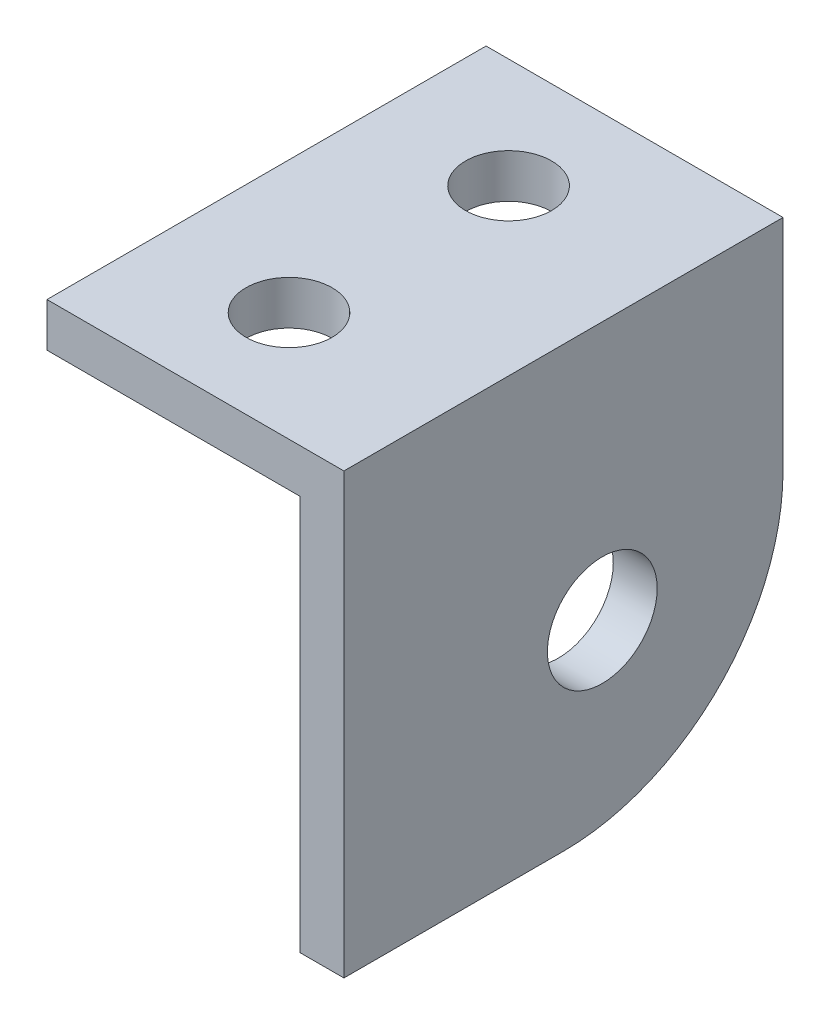
ISO-10303-21;
HEADER;
FILE_DESCRIPTION(('STEP AP214'),'2;1');
FILE_NAME('part.step','',(''),(''),'','','');
FILE_SCHEMA(('AUTOMOTIVE_DESIGN { 1 0 10303 214 1 1 1 1 }'));
ENDSEC;
DATA;
#1=APPLICATION_CONTEXT('core data for automotive mechanical design processes');
#2=APPLICATION_PROTOCOL_DEFINITION('international standard','automotive_design',2000,#1);
#3=PRODUCT_CONTEXT('',#1,'mechanical');
#4=PRODUCT('Part','Part','',(#3));
#5=PRODUCT_RELATED_PRODUCT_CATEGORY('part','',(#4));
#6=PRODUCT_DEFINITION_FORMATION('','',#4);
#7=PRODUCT_DEFINITION_CONTEXT('part definition',#1,'design');
#8=PRODUCT_DEFINITION('design','',#6,#7);
#9=PRODUCT_DEFINITION_SHAPE('','',#8);
#10=(LENGTH_UNIT() NAMED_UNIT(*) SI_UNIT(.MILLI.,.METRE.));
#11=(NAMED_UNIT(*) PLANE_ANGLE_UNIT() SI_UNIT($,.RADIAN.));
#12=(NAMED_UNIT(*) SI_UNIT($,.STERADIAN.) SOLID_ANGLE_UNIT());
#13=UNCERTAINTY_MEASURE_WITH_UNIT(LENGTH_MEASURE(1.E-05),#10,'distance_accuracy_value','');
#14=(GEOMETRIC_REPRESENTATION_CONTEXT(3) GLOBAL_UNCERTAINTY_ASSIGNED_CONTEXT((#13)) GLOBAL_UNIT_ASSIGNED_CONTEXT((#10,
#11,#12)) REPRESENTATION_CONTEXT('',''));
#15=CARTESIAN_POINT('',(0.,0.,0.));
#16=DIRECTION('',(0.,0.,1.));
#17=DIRECTION('',(1.,0.,0.));
#18=AXIS2_PLACEMENT_3D('',#15,#16,#17);
#19=CARTESIAN_POINT('',(-27.33675,12.7,25.4));
#20=DIRECTION('',(0.,-1.,0.));
#21=DIRECTION('',(0.,0.,-1.));
#22=AXIS2_PLACEMENT_3D('',#19,#20,#21);
#23=PLANE('',#22);
#24=CARTESIAN_POINT('',(-19.685,12.7,19.05));
#25=DIRECTION('',(0.,-1.,0.));
#26=DIRECTION('',(1.,0.,0.));
#27=AXIS2_PLACEMENT_3D('',#24,#25,#26);
#28=CIRCLE('',#27,2.4892);
#29=CARTESIAN_POINT('',(-17.1958,12.7,19.05));
#30=VERTEX_POINT('',#29);
#31=EDGE_CURVE('E154',#30,#30,#28,.T.);
#32=ORIENTED_EDGE('',*,*,#31,.T.);
#33=EDGE_LOOP('',(#32));
#34=FACE_BOUND('',#33,.T.);
#35=CARTESIAN_POINT('',(-19.685,12.7,6.35000000000001));
#36=DIRECTION('',(0.,-1.,0.));
#37=DIRECTION('',(1.,0.,0.));
#38=AXIS2_PLACEMENT_3D('',#35,#36,#37);
#39=CIRCLE('',#38,2.4892);
#40=CARTESIAN_POINT('',(-17.1958,12.7,6.35000000000001));
#41=VERTEX_POINT('',#40);
#42=EDGE_CURVE('E158',#41,#41,#39,.T.);
#43=ORIENTED_EDGE('',*,*,#42,.T.);
#44=EDGE_LOOP('',(#43));
#45=FACE_BOUND('',#44,.T.);
#46=DIRECTION('',(-1.,0.,0.));
#47=VECTOR('',#46,1.);
#48=CARTESIAN_POINT('',(-27.33675,12.7,0.));
#49=LINE('',#48,#47);
#50=CARTESIAN_POINT('',(-10.16,12.7,0.));
#51=VERTEX_POINT('',#50);
#52=CARTESIAN_POINT('',(-27.33675,12.7,0.));
#53=VERTEX_POINT('',#52);
#54=EDGE_CURVE('E116',#51,#53,#49,.T.);
#55=ORIENTED_EDGE('',*,*,#54,.T.);
#56=DIRECTION('',(0.,0.,-1.));
#57=VECTOR('',#56,1.);
#58=CARTESIAN_POINT('',(-27.33675,12.7,25.4));
#59=LINE('',#58,#57);
#60=CARTESIAN_POINT('',(-27.33675,12.7,25.4));
#61=VERTEX_POINT('',#60);
#62=EDGE_CURVE('E97',#61,#53,#59,.T.);
#63=ORIENTED_EDGE('',*,*,#62,.F.);
#64=DIRECTION('',(-1.,0.,0.));
#65=VECTOR('',#64,1.);
#66=CARTESIAN_POINT('',(-27.33675,12.7,25.4));
#67=LINE('',#66,#65);
#68=CARTESIAN_POINT('',(-10.16,12.7,25.4));
#69=VERTEX_POINT('',#68);
#70=EDGE_CURVE('E104',#69,#61,#67,.T.);
#71=ORIENTED_EDGE('',*,*,#70,.F.);
#72=DIRECTION('',(0.,0.,-1.));
#73=VECTOR('',#72,1.);
#74=CARTESIAN_POINT('',(-10.16,12.7,25.4));
#75=LINE('',#74,#73);
#76=EDGE_CURVE('E132',#69,#51,#75,.T.);
#77=ORIENTED_EDGE('',*,*,#76,.T.);
#78=EDGE_LOOP('',(#55,#63,#71,#77));
#79=FACE_BOUND('',#78,.T.);
#80=ADVANCED_FACE('F35',(#34,#45,#79),#23,.F.);
#81=CARTESIAN_POINT('',(-27.33675,10.16,25.4));
#82=DIRECTION('',(1.,0.,0.));
#83=DIRECTION('',(0.,0.,-1.));
#84=AXIS2_PLACEMENT_3D('',#81,#82,#83);
#85=PLANE('',#84);
#86=DIRECTION('',(0.,-1.,0.));
#87=VECTOR('',#86,1.);
#88=CARTESIAN_POINT('',(-27.33675,10.16,0.));
#89=LINE('',#88,#87);
#90=CARTESIAN_POINT('',(-27.33675,10.16,0.));
#91=VERTEX_POINT('',#90);
#92=EDGE_CURVE('E139',#53,#91,#89,.T.);
#93=ORIENTED_EDGE('',*,*,#92,.T.);
#94=DIRECTION('',(0.,0.,-1.));
#95=VECTOR('',#94,1.);
#96=CARTESIAN_POINT('',(-27.33675,10.16,25.4));
#97=LINE('',#96,#95);
#98=CARTESIAN_POINT('',(-27.33675,10.16,25.4));
#99=VERTEX_POINT('',#98);
#100=EDGE_CURVE('E100',#99,#91,#97,.T.);
#101=ORIENTED_EDGE('',*,*,#100,.F.);
#102=DIRECTION('',(0.,-1.,0.));
#103=VECTOR('',#102,1.);
#104=CARTESIAN_POINT('',(-27.33675,10.16,25.4));
#105=LINE('',#104,#103);
#106=EDGE_CURVE('E93',#61,#99,#105,.T.);
#107=ORIENTED_EDGE('',*,*,#106,.F.);
#108=ORIENTED_EDGE('',*,*,#62,.T.);
#109=EDGE_LOOP('',(#93,#101,#107,#108));
#110=FACE_BOUND('',#109,.T.);
#111=ADVANCED_FACE('F95',(#110),#85,.F.);
#112=CARTESIAN_POINT('',(-27.33675,10.16,25.4));
#113=DIRECTION('',(0.,1.,0.));
#114=DIRECTION('',(-1.,0.,0.));
#115=AXIS2_PLACEMENT_3D('',#112,#113,#114);
#116=PLANE('',#115);
#117=CARTESIAN_POINT('',(-19.685,10.16,19.05));
#118=DIRECTION('',(0.,-1.,0.));
#119=DIRECTION('',(1.,0.,0.));
#120=AXIS2_PLACEMENT_3D('',#117,#118,#119);
#121=CIRCLE('',#120,2.4892);
#122=CARTESIAN_POINT('',(-17.1958,10.16,19.05));
#123=VERTEX_POINT('',#122);
#124=EDGE_CURVE('E161',#123,#123,#121,.T.);
#125=ORIENTED_EDGE('',*,*,#124,.F.);
#126=EDGE_LOOP('',(#125));
#127=FACE_BOUND('',#126,.T.);
#128=CARTESIAN_POINT('',(-19.685,10.16,6.35000000000001));
#129=DIRECTION('',(0.,-1.,0.));
#130=DIRECTION('',(1.,0.,0.));
#131=AXIS2_PLACEMENT_3D('',#128,#129,#130);
#132=CIRCLE('',#131,2.4892);
#133=CARTESIAN_POINT('',(-17.1958,10.16,6.35000000000001));
#134=VERTEX_POINT('',#133);
#135=EDGE_CURVE('E155',#134,#134,#132,.T.);
#136=ORIENTED_EDGE('',*,*,#135,.F.);
#137=EDGE_LOOP('',(#136));
#138=FACE_BOUND('',#137,.T.);
#139=DIRECTION('',(1.,0.,0.));
#140=VECTOR('',#139,1.);
#141=CARTESIAN_POINT('',(-27.33675,10.16,0.));
#142=LINE('',#141,#140);
#143=CARTESIAN_POINT('',(-12.7,10.16,0.));
#144=VERTEX_POINT('',#143);
#145=EDGE_CURVE('E137',#91,#144,#142,.T.);
#146=ORIENTED_EDGE('',*,*,#145,.T.);
#147=DIRECTION('',(0.,0.,-1.));
#148=VECTOR('',#147,1.);
#149=CARTESIAN_POINT('',(-12.7,10.16,25.4));
#150=LINE('',#149,#148);
#151=CARTESIAN_POINT('',(-12.7,10.16,25.4));
#152=VERTEX_POINT('',#151);
#153=EDGE_CURVE('E121',#152,#144,#150,.T.);
#154=ORIENTED_EDGE('',*,*,#153,.F.);
#155=DIRECTION('',(1.,0.,0.));
#156=VECTOR('',#155,1.);
#157=CARTESIAN_POINT('',(-27.33675,10.16,25.4));
#158=LINE('',#157,#156);
#159=EDGE_CURVE('E103',#99,#152,#158,.T.);
#160=ORIENTED_EDGE('',*,*,#159,.F.);
#161=ORIENTED_EDGE('',*,*,#100,.T.);
#162=EDGE_LOOP('',(#146,#154,#160,#161));
#163=FACE_BOUND('',#162,.T.);
#164=ADVANCED_FACE('F176',(#127,#138,#163),#116,.F.);
#165=CARTESIAN_POINT('',(-12.7,10.16,25.4));
#166=DIRECTION('',(1.,0.,0.));
#167=DIRECTION('',(0.,1.,0.));
#168=AXIS2_PLACEMENT_3D('',#165,#166,#167);
#169=PLANE('',#168);
#170=CARTESIAN_POINT('',(-12.7,-2.24506403026729,10.4549359697327));
#171=DIRECTION('',(1.,0.,0.));
#172=DIRECTION('',(0.,1.,0.));
#173=AXIS2_PLACEMENT_3D('',#170,#171,#172);
#174=CIRCLE('',#173,3.175);
#175=CARTESIAN_POINT('',(-12.7,0.929935969732713,10.4549359697327));
#176=VERTEX_POINT('',#175);
#177=EDGE_CURVE('E142',#176,#176,#174,.T.);
#178=ORIENTED_EDGE('',*,*,#177,.T.);
#179=EDGE_LOOP('',(#178));
#180=FACE_BOUND('',#179,.T.);
#181=DIRECTION('',(0.,-1.,0.));
#182=VECTOR('',#181,1.);
#183=CARTESIAN_POINT('',(-12.7,10.16,0.));
#184=LINE('',#183,#182);
#185=CARTESIAN_POINT('',(-12.7,0.,0.));
#186=VERTEX_POINT('',#185);
#187=EDGE_CURVE('E135',#144,#186,#184,.T.);
#188=ORIENTED_EDGE('',*,*,#187,.T.);
#189=CARTESIAN_POINT('',(-12.7,0.,12.7));
#190=DIRECTION('',(1.,0.,0.));
#191=DIRECTION('',(0.,1.,0.));
#192=AXIS2_PLACEMENT_3D('',#189,#190,#191);
#193=CIRCLE('',#192,12.7);
#194=CARTESIAN_POINT('',(-12.7,-12.7,12.7));
#195=VERTEX_POINT('',#194);
#196=EDGE_CURVE('E11',#186,#195,#193,.F.);
#197=ORIENTED_EDGE('',*,*,#196,.T.);
#198=DIRECTION('',(0.,0.,-1.));
#199=VECTOR('',#198,1.);
#200=CARTESIAN_POINT('',(-12.7,-12.7,25.4));
#201=LINE('',#200,#199);
#202=CARTESIAN_POINT('',(-12.7,-12.7,25.4));
#203=VERTEX_POINT('',#202);
#204=EDGE_CURVE('E127',#203,#195,#201,.T.);
#205=ORIENTED_EDGE('',*,*,#204,.F.);
#206=DIRECTION('',(0.,-1.,0.));
#207=VECTOR('',#206,1.);
#208=CARTESIAN_POINT('',(-12.7,10.16,25.4));
#209=LINE('',#208,#207);
#210=EDGE_CURVE('E146',#152,#203,#209,.T.);
#211=ORIENTED_EDGE('',*,*,#210,.F.);
#212=ORIENTED_EDGE('',*,*,#153,.T.);
#213=EDGE_LOOP('',(#188,#197,#205,#211,#212));
#214=FACE_BOUND('',#213,.T.);
#215=ADVANCED_FACE('F179',(#180,#214),#169,.F.);
#216=CARTESIAN_POINT('',(-12.7,-12.7,25.4));
#217=DIRECTION('',(0.,1.,0.));
#218=DIRECTION('',(-1.,0.,0.));
#219=AXIS2_PLACEMENT_3D('',#216,#217,#218);
#220=PLANE('',#219);
#221=ORIENTED_EDGE('',*,*,#204,.T.);
#222=DIRECTION('',(1.,0.,0.));
#223=VECTOR('',#222,1.);
#224=CARTESIAN_POINT('',(-12.7,-12.7,12.7));
#225=LINE('',#224,#223);
#226=CARTESIAN_POINT('',(-10.16,-12.7,12.7));
#227=VERTEX_POINT('',#226);
#228=EDGE_CURVE('E117',#195,#227,#225,.T.);
#229=ORIENTED_EDGE('',*,*,#228,.T.);
#230=DIRECTION('',(0.,0.,-1.));
#231=VECTOR('',#230,1.);
#232=CARTESIAN_POINT('',(-10.16,-12.7,25.4));
#233=LINE('',#232,#231);
#234=CARTESIAN_POINT('',(-10.16,-12.7,25.4));
#235=VERTEX_POINT('',#234);
#236=EDGE_CURVE('E130',#235,#227,#233,.T.);
#237=ORIENTED_EDGE('',*,*,#236,.F.);
#238=DIRECTION('',(1.,0.,0.));
#239=VECTOR('',#238,1.);
#240=CARTESIAN_POINT('',(-12.7,-12.7,25.4));
#241=LINE('',#240,#239);
#242=EDGE_CURVE('E144',#203,#235,#241,.T.);
#243=ORIENTED_EDGE('',*,*,#242,.F.);
#244=EDGE_LOOP('',(#221,#229,#237,#243));
#245=FACE_BOUND('',#244,.T.);
#246=ADVANCED_FACE('F209',(#245),#220,.F.);
#247=CARTESIAN_POINT('',(-10.16,-12.7,25.4));
#248=DIRECTION('',(-1.,0.,0.));
#249=DIRECTION('',(0.,0.,1.));
#250=AXIS2_PLACEMENT_3D('',#247,#248,#249);
#251=PLANE('',#250);
#252=CARTESIAN_POINT('',(-10.16,-2.24506403026729,10.4549359697327));
#253=DIRECTION('',(1.,0.,0.));
#254=DIRECTION('',(0.,0.,-1.));
#255=AXIS2_PLACEMENT_3D('',#252,#253,#254);
#256=CIRCLE('',#255,3.175);
#257=CARTESIAN_POINT('',(-10.16,-2.24506403026729,7.27993596973271));
#258=VERTEX_POINT('',#257);
#259=EDGE_CURVE('E151',#258,#258,#256,.T.);
#260=ORIENTED_EDGE('',*,*,#259,.F.);
#261=EDGE_LOOP('',(#260));
#262=FACE_BOUND('',#261,.T.);
#263=ORIENTED_EDGE('',*,*,#236,.T.);
#264=CARTESIAN_POINT('',(-10.16,0.,12.7));
#265=DIRECTION('',(-1.,0.,0.));
#266=DIRECTION('',(0.,0.,1.));
#267=AXIS2_PLACEMENT_3D('',#264,#265,#266);
#268=CIRCLE('',#267,12.7);
#269=CARTESIAN_POINT('',(-10.16,0.,0.));
#270=VERTEX_POINT('',#269);
#271=EDGE_CURVE('E57',#227,#270,#268,.F.);
#272=ORIENTED_EDGE('',*,*,#271,.T.);
#273=DIRECTION('',(0.,1.,0.));
#274=VECTOR('',#273,1.);
#275=CARTESIAN_POINT('',(-10.16,-12.7,0.));
#276=LINE('',#275,#274);
#277=EDGE_CURVE('E113',#270,#51,#276,.T.);
#278=ORIENTED_EDGE('',*,*,#277,.T.);
#279=ORIENTED_EDGE('',*,*,#76,.F.);
#280=DIRECTION('',(0.,1.,0.));
#281=VECTOR('',#280,1.);
#282=CARTESIAN_POINT('',(-10.16,-12.7,25.4));
#283=LINE('',#282,#281);
#284=EDGE_CURVE('E109',#235,#69,#283,.T.);
#285=ORIENTED_EDGE('',*,*,#284,.F.);
#286=EDGE_LOOP('',(#263,#272,#278,#279,#285));
#287=FACE_BOUND('',#286,.T.);
#288=ADVANCED_FACE('F198',(#262,#287),#251,.F.);
#289=CARTESIAN_POINT('',(0.,0.,25.4));
#290=DIRECTION('',(0.,0.,1.));
#291=DIRECTION('',(1.,0.,0.));
#292=AXIS2_PLACEMENT_3D('',#289,#290,#291);
#293=PLANE('',#292);
#294=ORIENTED_EDGE('',*,*,#70,.T.);
#295=ORIENTED_EDGE('',*,*,#106,.T.);
#296=ORIENTED_EDGE('',*,*,#159,.T.);
#297=ORIENTED_EDGE('',*,*,#210,.T.);
#298=ORIENTED_EDGE('',*,*,#242,.T.);
#299=ORIENTED_EDGE('',*,*,#284,.T.);
#300=EDGE_LOOP('',(#294,#295,#296,#297,#298,#299));
#301=FACE_BOUND('',#300,.T.);
#302=ADVANCED_FACE('F107',(#301),#293,.T.);
#303=CARTESIAN_POINT('',(0.,0.,0.));
#304=DIRECTION('',(0.,0.,1.));
#305=DIRECTION('',(1.,0.,0.));
#306=AXIS2_PLACEMENT_3D('',#303,#304,#305);
#307=PLANE('',#306);
#308=ORIENTED_EDGE('',*,*,#277,.F.);
#309=DIRECTION('',(1.,0.,0.));
#310=VECTOR('',#309,1.);
#311=CARTESIAN_POINT('',(0.,0.,0.));
#312=LINE('',#311,#310);
#313=EDGE_CURVE('E43',#270,#186,#312,.F.);
#314=ORIENTED_EDGE('',*,*,#313,.T.);
#315=ORIENTED_EDGE('',*,*,#187,.F.);
#316=ORIENTED_EDGE('',*,*,#145,.F.);
#317=ORIENTED_EDGE('',*,*,#92,.F.);
#318=ORIENTED_EDGE('',*,*,#54,.F.);
#319=EDGE_LOOP('',(#308,#314,#315,#316,#317,#318));
#320=FACE_BOUND('',#319,.T.);
#321=ADVANCED_FACE('F189',(#320),#307,.F.);
#322=CARTESIAN_POINT('',(-12.7,0.,12.7));
#323=DIRECTION('',(1.,0.,0.));
#324=DIRECTION('',(0.,1.,0.));
#325=AXIS2_PLACEMENT_3D('',#322,#323,#324);
#326=CYLINDRICAL_SURFACE('',#325,12.7);
#327=ORIENTED_EDGE('',*,*,#196,.F.);
#328=ORIENTED_EDGE('',*,*,#313,.F.);
#329=ORIENTED_EDGE('',*,*,#271,.F.);
#330=ORIENTED_EDGE('',*,*,#228,.F.);
#331=EDGE_LOOP('',(#327,#328,#329,#330));
#332=FACE_BOUND('',#331,.T.);
#333=ADVANCED_FACE('F37',(#332),#326,.T.);
#334=CARTESIAN_POINT('',(-27.33675,-2.24506403026729,10.4549359697327));
#335=DIRECTION('',(1.,0.,0.));
#336=DIRECTION('',(0.,0.,-1.));
#337=AXIS2_PLACEMENT_3D('',#334,#335,#336);
#338=CYLINDRICAL_SURFACE('',#337,3.175);
#339=ORIENTED_EDGE('',*,*,#259,.T.);
#340=EDGE_LOOP('',(#339));
#341=FACE_BOUND('',#340,.T.);
#342=ORIENTED_EDGE('',*,*,#177,.F.);
#343=EDGE_LOOP('',(#342));
#344=FACE_BOUND('',#343,.T.);
#345=ADVANCED_FACE('F196',(#341,#344),#338,.F.);
#346=CARTESIAN_POINT('',(-19.685,12.7,6.35000000000001));
#347=DIRECTION('',(0.,-1.,0.));
#348=DIRECTION('',(1.,0.,0.));
#349=AXIS2_PLACEMENT_3D('',#346,#347,#348);
#350=CYLINDRICAL_SURFACE('',#349,2.4892);
#351=ORIENTED_EDGE('',*,*,#42,.F.);
#352=EDGE_LOOP('',(#351));
#353=FACE_BOUND('',#352,.T.);
#354=ORIENTED_EDGE('',*,*,#135,.T.);
#355=EDGE_LOOP('',(#354));
#356=FACE_BOUND('',#355,.T.);
#357=ADVANCED_FACE('F172',(#353,#356),#350,.F.);
#358=CARTESIAN_POINT('',(-19.685,12.7,19.05));
#359=DIRECTION('',(0.,-1.,0.));
#360=DIRECTION('',(1.,0.,0.));
#361=AXIS2_PLACEMENT_3D('',#358,#359,#360);
#362=CYLINDRICAL_SURFACE('',#361,2.4892);
#363=ORIENTED_EDGE('',*,*,#31,.F.);
#364=EDGE_LOOP('',(#363));
#365=FACE_BOUND('',#364,.T.);
#366=ORIENTED_EDGE('',*,*,#124,.T.);
#367=EDGE_LOOP('',(#366));
#368=FACE_BOUND('',#367,.T.);
#369=ADVANCED_FACE('F169',(#365,#368),#362,.F.);
#370=CLOSED_SHELL('',(#80,#111,#164,#215,#246,#288,#302,#321,#333,#345,#357,#369));
#371=MANIFOLD_SOLID_BREP('B2',#370);
#372=ADVANCED_BREP_SHAPE_REPRESENTATION('',(#18,#371),#14);
#373=SHAPE_DEFINITION_REPRESENTATION(#9,#372);
ENDSEC;
END-ISO-10303-21;
